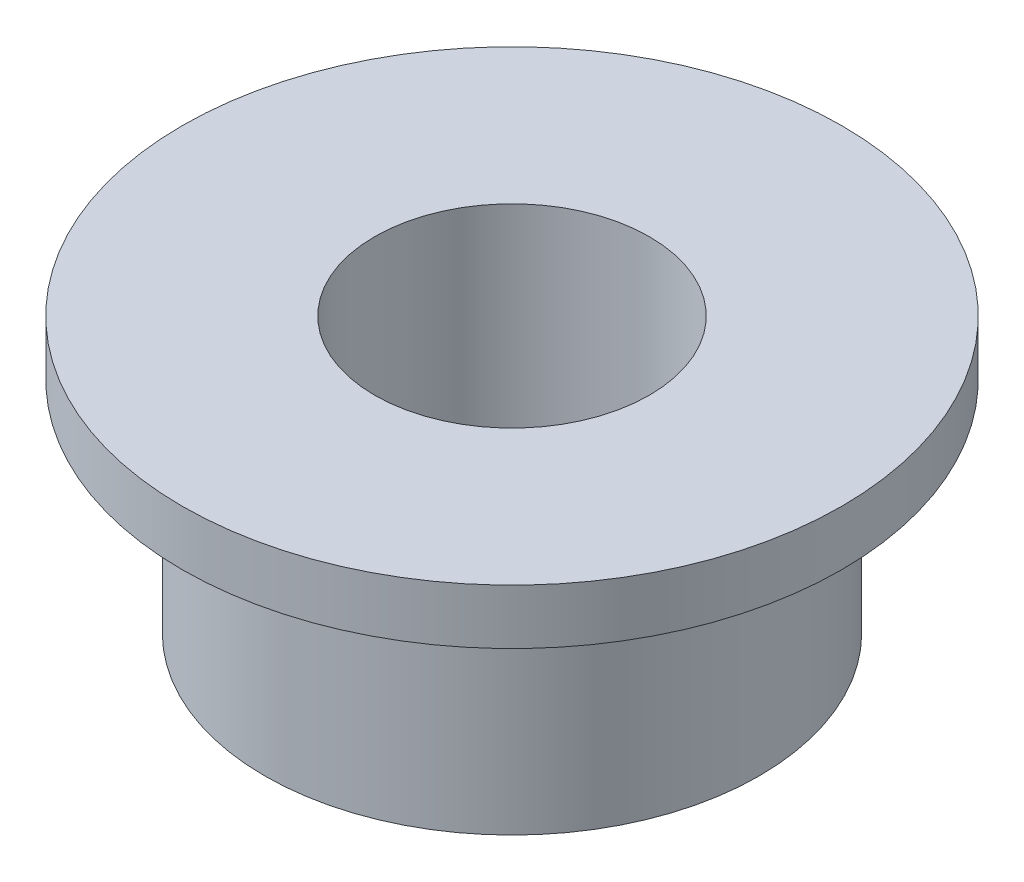
ISO-10303-21;
HEADER;
FILE_DESCRIPTION(('STEP AP214'),'2;1');
FILE_NAME('part.step','',(''),(''),'','','');
FILE_SCHEMA(('AUTOMOTIVE_DESIGN { 1 0 10303 214 1 1 1 1 }'));
ENDSEC;
DATA;
#1=APPLICATION_CONTEXT('core data for automotive mechanical design processes');
#2=APPLICATION_PROTOCOL_DEFINITION('international standard','automotive_design',2000,#1);
#3=PRODUCT_CONTEXT('',#1,'mechanical');
#4=PRODUCT('Part','Part','',(#3));
#5=PRODUCT_RELATED_PRODUCT_CATEGORY('part','',(#4));
#6=PRODUCT_DEFINITION_FORMATION('','',#4);
#7=PRODUCT_DEFINITION_CONTEXT('part definition',#1,'design');
#8=PRODUCT_DEFINITION('design','',#6,#7);
#9=PRODUCT_DEFINITION_SHAPE('','',#8);
#10=(LENGTH_UNIT() NAMED_UNIT(*) SI_UNIT(.MILLI.,.METRE.));
#11=(NAMED_UNIT(*) PLANE_ANGLE_UNIT() SI_UNIT($,.RADIAN.));
#12=(NAMED_UNIT(*) SI_UNIT($,.STERADIAN.) SOLID_ANGLE_UNIT());
#13=UNCERTAINTY_MEASURE_WITH_UNIT(LENGTH_MEASURE(1.E-05),#10,'distance_accuracy_value','');
#14=(GEOMETRIC_REPRESENTATION_CONTEXT(3) GLOBAL_UNCERTAINTY_ASSIGNED_CONTEXT((#13)) GLOBAL_UNIT_ASSIGNED_CONTEXT((#10,
#11,#12)) REPRESENTATION_CONTEXT('',''));
#15=CARTESIAN_POINT('',(0.,0.,0.));
#16=DIRECTION('',(0.,0.,1.));
#17=DIRECTION('',(1.,0.,0.));
#18=AXIS2_PLACEMENT_3D('',#15,#16,#17);
#19=CARTESIAN_POINT('',(-45.,-15.,0.));
#20=DIRECTION('',(0.,1.,0.));
#21=DIRECTION('',(-1.,0.,0.));
#22=AXIS2_PLACEMENT_3D('',#19,#20,#21);
#23=CYLINDRICAL_SURFACE('',#22,45.);
#24=CARTESIAN_POINT('',(-45.,0.,0.));
#25=DIRECTION('',(0.,1.,0.));
#26=DIRECTION('',(-1.,0.,0.));
#27=AXIS2_PLACEMENT_3D('',#24,#25,#26);
#28=CIRCLE('',#27,45.);
#29=CARTESIAN_POINT('',(-90.,0.,0.));
#30=VERTEX_POINT('',#29);
#31=EDGE_CURVE('E70',#30,#30,#28,.T.);
#32=ORIENTED_EDGE('',*,*,#31,.F.);
#33=EDGE_LOOP('',(#32));
#34=FACE_BOUND('',#33,.T.);
#35=CARTESIAN_POINT('',(-45.,-40.,0.));
#36=DIRECTION('',(0.,1.,0.));
#37=DIRECTION('',(-1.,0.,0.));
#38=AXIS2_PLACEMENT_3D('',#35,#36,#37);
#39=CIRCLE('',#38,45.);
#40=CARTESIAN_POINT('',(-90.,-40.,0.));
#41=VERTEX_POINT('',#40);
#42=EDGE_CURVE('E10',#41,#41,#39,.T.);
#43=ORIENTED_EDGE('',*,*,#42,.T.);
#44=EDGE_LOOP('',(#43));
#45=FACE_BOUND('',#44,.T.);
#46=ADVANCED_FACE('F43',(#34,#45),#23,.T.);
#47=CARTESIAN_POINT('',(-20.,-40.,0.));
#48=DIRECTION('',(0.,1.,0.));
#49=DIRECTION('',(-1.,0.,0.));
#50=AXIS2_PLACEMENT_3D('',#47,#48,#49);
#51=PLANE('',#50);
#52=ORIENTED_EDGE('',*,*,#42,.F.);
#53=EDGE_LOOP('',(#52));
#54=FACE_BOUND('',#53,.T.);
#55=CARTESIAN_POINT('',(-45.,-40.,0.));
#56=DIRECTION('',(0.,1.,0.));
#57=DIRECTION('',(-1.,0.,0.));
#58=AXIS2_PLACEMENT_3D('',#55,#56,#57);
#59=CIRCLE('',#58,25.);
#60=CARTESIAN_POINT('',(-70.,-40.,0.));
#61=VERTEX_POINT('',#60);
#62=EDGE_CURVE('E50',#61,#61,#59,.T.);
#63=ORIENTED_EDGE('',*,*,#62,.T.);
#64=EDGE_LOOP('',(#63));
#65=FACE_BOUND('',#64,.T.);
#66=ADVANCED_FACE('F78',(#54,#65),#51,.F.);
#67=CARTESIAN_POINT('',(-45.,-15.,0.));
#68=DIRECTION('',(0.,1.,0.));
#69=DIRECTION('',(-1.,0.,0.));
#70=AXIS2_PLACEMENT_3D('',#67,#68,#69);
#71=CYLINDRICAL_SURFACE('',#70,25.);
#72=ORIENTED_EDGE('',*,*,#62,.F.);
#73=EDGE_LOOP('',(#72));
#74=FACE_BOUND('',#73,.T.);
#75=CARTESIAN_POINT('',(-45.,9.99999999999999,0.));
#76=DIRECTION('',(0.,1.,0.));
#77=DIRECTION('',(-1.,0.,0.));
#78=AXIS2_PLACEMENT_3D('',#75,#76,#77);
#79=CIRCLE('',#78,25.);
#80=CARTESIAN_POINT('',(-70.,9.99999999999999,0.));
#81=VERTEX_POINT('',#80);
#82=EDGE_CURVE('E55',#81,#81,#79,.T.);
#83=ORIENTED_EDGE('',*,*,#82,.T.);
#84=EDGE_LOOP('',(#83));
#85=FACE_BOUND('',#84,.T.);
#86=ADVANCED_FACE('F82',(#74,#85),#71,.F.);
#87=CARTESIAN_POINT('',(15.,10.,0.));
#88=DIRECTION('',(0.,-1.,0.));
#89=DIRECTION('',(1.,0.,0.));
#90=AXIS2_PLACEMENT_3D('',#87,#88,#89);
#91=PLANE('',#90);
#92=ORIENTED_EDGE('',*,*,#82,.F.);
#93=EDGE_LOOP('',(#92));
#94=FACE_BOUND('',#93,.T.);
#95=CARTESIAN_POINT('',(-45.,9.99999999999999,0.));
#96=DIRECTION('',(0.,1.,0.));
#97=DIRECTION('',(-1.,0.,0.));
#98=AXIS2_PLACEMENT_3D('',#95,#96,#97);
#99=CIRCLE('',#98,60.);
#100=CARTESIAN_POINT('',(-105.,9.99999999999997,0.));
#101=VERTEX_POINT('',#100);
#102=EDGE_CURVE('E60',#101,#101,#99,.T.);
#103=ORIENTED_EDGE('',*,*,#102,.T.);
#104=EDGE_LOOP('',(#103));
#105=FACE_BOUND('',#104,.T.);
#106=ADVANCED_FACE('F87',(#94,#105),#91,.F.);
#107=CARTESIAN_POINT('',(-45.,-15.,0.));
#108=DIRECTION('',(0.,1.,0.));
#109=DIRECTION('',(-1.,0.,0.));
#110=AXIS2_PLACEMENT_3D('',#107,#108,#109);
#111=CYLINDRICAL_SURFACE('',#110,60.);
#112=ORIENTED_EDGE('',*,*,#102,.F.);
#113=EDGE_LOOP('',(#112));
#114=FACE_BOUND('',#113,.T.);
#115=CARTESIAN_POINT('',(-45.,0.,0.));
#116=DIRECTION('',(0.,1.,0.));
#117=DIRECTION('',(-1.,0.,0.));
#118=AXIS2_PLACEMENT_3D('',#115,#116,#117);
#119=CIRCLE('',#118,60.);
#120=CARTESIAN_POINT('',(-105.,0.,0.));
#121=VERTEX_POINT('',#120);
#122=EDGE_CURVE('E66',#121,#121,#119,.T.);
#123=ORIENTED_EDGE('',*,*,#122,.T.);
#124=EDGE_LOOP('',(#123));
#125=FACE_BOUND('',#124,.T.);
#126=ADVANCED_FACE('F93',(#114,#125),#111,.T.);
#127=CARTESIAN_POINT('',(0.,0.,0.));
#128=DIRECTION('',(0.,1.,0.));
#129=DIRECTION('',(-1.,0.,0.));
#130=AXIS2_PLACEMENT_3D('',#127,#128,#129);
#131=PLANE('',#130);
#132=ORIENTED_EDGE('',*,*,#122,.F.);
#133=EDGE_LOOP('',(#132));
#134=FACE_BOUND('',#133,.T.);
#135=ORIENTED_EDGE('',*,*,#31,.T.);
#136=EDGE_LOOP('',(#135));
#137=FACE_BOUND('',#136,.T.);
#138=ADVANCED_FACE('F75',(#134,#137),#131,.F.);
#139=CLOSED_SHELL('',(#46,#66,#86,#106,#126,#138));
#140=MANIFOLD_SOLID_BREP('B2',#139);
#141=ADVANCED_BREP_SHAPE_REPRESENTATION('',(#18,#140),#14);
#142=SHAPE_DEFINITION_REPRESENTATION(#9,#141);
ENDSEC;
END-ISO-10303-21;
